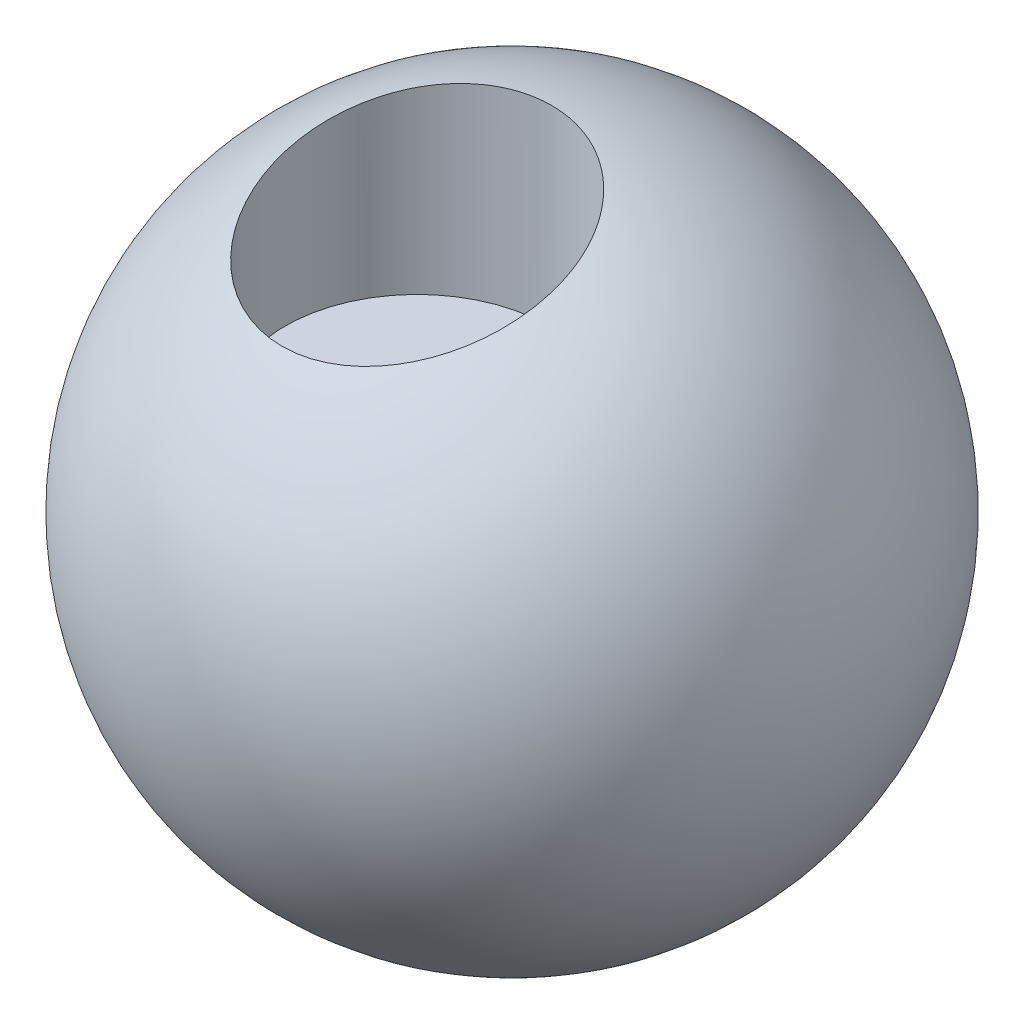
ISO-10303-21;
HEADER;
FILE_DESCRIPTION(('STEP AP214'),'2;1');
FILE_NAME('part.step','',(''),(''),'','','');
FILE_SCHEMA(('AUTOMOTIVE_DESIGN { 1 0 10303 214 1 1 1 1 }'));
ENDSEC;
DATA;
#1=APPLICATION_CONTEXT('core data for automotive mechanical design processes');
#2=APPLICATION_PROTOCOL_DEFINITION('international standard','automotive_design',2000,#1);
#3=PRODUCT_CONTEXT('',#1,'mechanical');
#4=PRODUCT('Part','Part','',(#3));
#5=PRODUCT_RELATED_PRODUCT_CATEGORY('part','',(#4));
#6=PRODUCT_DEFINITION_FORMATION('','',#4);
#7=PRODUCT_DEFINITION_CONTEXT('part definition',#1,'design');
#8=PRODUCT_DEFINITION('design','',#6,#7);
#9=PRODUCT_DEFINITION_SHAPE('','',#8);
#10=(LENGTH_UNIT() NAMED_UNIT(*) SI_UNIT(.MILLI.,.METRE.));
#11=(NAMED_UNIT(*) PLANE_ANGLE_UNIT() SI_UNIT($,.RADIAN.));
#12=(NAMED_UNIT(*) SI_UNIT($,.STERADIAN.) SOLID_ANGLE_UNIT());
#13=UNCERTAINTY_MEASURE_WITH_UNIT(LENGTH_MEASURE(1.E-05),#10,'distance_accuracy_value','');
#14=(GEOMETRIC_REPRESENTATION_CONTEXT(3) GLOBAL_UNCERTAINTY_ASSIGNED_CONTEXT((#13)) GLOBAL_UNIT_ASSIGNED_CONTEXT((#10,
#11,#12)) REPRESENTATION_CONTEXT('',''));
#15=CARTESIAN_POINT('',(0.,0.,0.));
#16=DIRECTION('',(0.,0.,1.));
#17=DIRECTION('',(1.,0.,0.));
#18=AXIS2_PLACEMENT_3D('',#15,#16,#17);
#19=CARTESIAN_POINT('',(0.,0.,0.));
#20=DIRECTION('',(0.,1.,0.));
#21=DIRECTION('',(1.,0.,0.));
#22=AXIS2_PLACEMENT_3D('',#19,#20,#21);
#23=SPHERICAL_SURFACE('',#22,100.);
#24=CARTESIAN_POINT('',(-32.3830651394079,94.6106608616789,-0.399929360318711));
#25=CARTESIAN_POINT('',(-31.6484898693131,94.8586068919636,-1.2231163236754));
#26=CARTESIAN_POINT('',(-30.8785275355345,95.0985040196887,-2.01736783511646));
#27=CARTESIAN_POINT('',(-29.2725197140086,95.5607401113787,-3.54178159135165));
#28=CARTESIAN_POINT('',(-28.4364629080942,95.7830760550382,-4.27193281409045));
#29=CARTESIAN_POINT('',(-26.702875064635,96.2089912006718,-5.6628303610567));
#30=CARTESIAN_POINT('',(-25.8052978085065,96.4125560251036,-6.32352353799325));
#31=CARTESIAN_POINT('',(-23.955119798305,96.7994701867778,-7.5694159173198));
#32=CARTESIAN_POINT('',(-23.0025215093706,96.9828204286366,-8.15461849816508));
#33=CARTESIAN_POINT('',(-21.0476916461981,97.3283375299546,-9.24516928692234));
#34=CARTESIAN_POINT('',(-20.0454113770106,97.4904830162413,-9.75043703104627));
#35=CARTESIAN_POINT('',(-17.9990659550323,97.7923336164436,-10.6759985997013));
#36=CARTESIAN_POINT('',(-16.9550001836488,97.9320383979934,-11.0962911657018));
#37=CARTESIAN_POINT('',(-14.8328242092969,98.1880598512669,-11.8480171291138));
#38=CARTESIAN_POINT('',(-13.7547216662283,98.3043817424542,-12.1794703625123));
#39=CARTESIAN_POINT('',(-11.5721862965373,98.512898750706,-12.7505483372701));
#40=CARTESIAN_POINT('',(-10.4677540556183,98.6050944039126,-12.9901751192856));
#41=CARTESIAN_POINT('',(-8.26580742904155,98.7629476882267,-13.370975783008));
#42=CARTESIAN_POINT('',(-7.16869278514396,98.8291537960783,-13.5142358907836));
#43=CARTESIAN_POINT('',(-4.96518769533131,98.9374832488853,-13.7093975265995));
#44=CARTESIAN_POINT('',(-3.858797374327,98.9796069176196,-13.7613002829228));
#45=CARTESIAN_POINT('',(-1.64494365989079,99.0394921856506,-13.7731367906991));
#46=CARTESIAN_POINT('',(-0.537480348322362,99.0572555163821,-13.7330770790162));
#47=CARTESIAN_POINT('',(1.67042289962503,99.0683079636529,-13.5611995544122));
#48=CARTESIAN_POINT('',(2.77086289530533,99.0615972871127,-13.4293825172806));
#49=CARTESIAN_POINT('',(4.93828085232615,99.0240645861383,-13.0779750524453));
#50=CARTESIAN_POINT('',(6.00551056467394,98.9936482800077,-12.8598917000578));
#51=CARTESIAN_POINT('',(8.1177556072271,98.9093939375682,-12.337712029197));
#52=CARTESIAN_POINT('',(9.16277124532439,98.8555562261073,-12.0336169037025));
#53=CARTESIAN_POINT('',(11.2232378034236,98.7248026268273,-11.3418495218075));
#54=CARTESIAN_POINT('',(12.2386894933176,98.6478873405755,-10.954179444045));
#55=CARTESIAN_POINT('',(14.2330520337276,98.4714613699761,-10.0983563767361));
#56=CARTESIAN_POINT('',(15.2119626294094,98.3719505280834,-9.63020282603316));
#57=CARTESIAN_POINT('',(17.1295605591064,98.1506116266202,-8.61557622541087));
#58=CARTESIAN_POINT('',(18.0681150323122,98.0287159210003,-8.0688669033833));
#59=CARTESIAN_POINT('',(19.8955642108477,97.7635624080653,-6.9025326659921));
#60=CARTESIAN_POINT('',(20.7844589916452,97.6203046332153,-6.28290786144236));
#61=CARTESIAN_POINT('',(22.5069194697475,97.3132851645895,-4.97551651572422));
#62=CARTESIAN_POINT('',(23.3404824586527,97.1495224682626,-4.28774664306902));
#63=CARTESIAN_POINT('',(24.947066707269,96.8024689949829,-2.84931178528893));
#64=CARTESIAN_POINT('',(25.7200870047466,96.6191779077655,-2.09864580091896));
#65=CARTESIAN_POINT('',(27.2169002997578,96.2299904775005,-0.52321954412828));
#66=CARTESIAN_POINT('',(27.9392774884156,96.0236928311013,0.302786807438496));
#67=CARTESIAN_POINT('',(29.3117441413944,95.5930574301269,2.00839074924652));
#68=CARTESIAN_POINT('',(29.9618328112277,95.3687194773262,2.8879889283248));
#69=CARTESIAN_POINT('',(31.1861152214535,94.903284336931,4.69442598454119));
#70=CARTESIAN_POINT('',(31.7603009801161,94.6621853908604,5.62126981571781));
#71=CARTESIAN_POINT('',(32.8296433015031,94.1646234574064,7.51552423346298));
#72=CARTESIAN_POINT('',(33.3247983113478,93.9081601682643,8.48293561667412));
#73=CARTESIAN_POINT('',(34.2488065738092,93.3724916814081,10.4845827478801));
#74=CARTESIAN_POINT('',(34.6748890183794,93.0928127813576,11.5199713102564));
#75=CARTESIAN_POINT('',(35.4379074588145,92.5202291670221,13.6195280651164));
#76=CARTESIAN_POINT('',(35.7748416869586,92.2273241906119,14.6836968278221));
#77=CARTESIAN_POINT('',(36.3581126459558,91.6299570254163,16.8335531009702));
#78=CARTESIAN_POINT('',(36.6044372095379,91.3254932905459,17.9192434807702));
#79=CARTESIAN_POINT('',(37.005509299737,90.7068073910667,20.1046606253297));
#80=CARTESIAN_POINT('',(37.160255148842,90.3925850478137,21.2043876468313));
#81=CARTESIAN_POINT('',(37.3815936119765,89.7450183617277,23.4493720475143));
#82=CARTESIAN_POINT('',(37.4449003053837,89.411389994249,24.5948723176336));
#83=CARTESIAN_POINT('',(37.4730858131538,88.7376993930454,26.8851947612217));
#84=CARTESIAN_POINT('',(37.4379623586843,88.3976370111948,28.0300169184516));
#85=CARTESIAN_POINT('',(37.2699243941424,87.7131805847972,30.3113199073015));
#86=CARTESIAN_POINT('',(37.1369969255852,87.3687859721976,31.447799613439));
#87=CARTESIAN_POINT('',(36.7744822391675,86.6779268470211,33.7045986886156));
#88=CARTESIAN_POINT('',(36.5448940069197,86.3314623127595,34.8249178879338));
#89=CARTESIAN_POINT('',(35.9840357018398,85.6304686232415,37.0684022191492));
#90=CARTESIAN_POINT('',(35.6504651704888,85.2759447593002,38.1909946452647));
#91=CARTESIAN_POINT('',(34.8858975886999,84.5696867042178,40.4034262857302));
#92=CARTESIAN_POINT('',(34.4548986393321,84.2179525675882,41.4932648612216));
#93=CARTESIAN_POINT('',(33.4981681640389,83.5199080527811,43.6324705336872));
#94=CARTESIAN_POINT('',(32.972429187979,83.1735981034785,44.6818344399436));
#95=CARTESIAN_POINT('',(31.8294851975645,82.4891968992823,46.7323342859823));
#96=CARTESIAN_POINT('',(31.2122808140954,82.1511055877191,47.7334705583532));
#97=CARTESIAN_POINT('',(29.8903800808977,81.4861109219506,49.6797020861451));
#98=CARTESIAN_POINT('',(29.1857105245716,81.1592041805033,50.6248143730781));
#99=CARTESIAN_POINT('',(27.6930686865017,80.5194366819795,52.4519607235882));
#100=CARTESIAN_POINT('',(26.9050957791771,80.2065760304096,53.3339943133815));
#101=CARTESIAN_POINT('',(25.2508887799305,79.5979846485927,55.0276947693849));
#102=CARTESIAN_POINT('',(24.3846606862267,79.3022526082936,55.8393670194246));
#103=CARTESIAN_POINT('',(22.5795636247118,78.7310177593839,57.3853965785069));
#104=CARTESIAN_POINT('',(21.6406970462414,78.4555142859636,58.1197564287579));
#105=CARTESIAN_POINT('',(19.7272721517931,77.9361618256534,59.4826935235949));
#106=CARTESIAN_POINT('',(18.754760071041,77.6915905491046,60.1138681852551));
#107=CARTESIAN_POINT('',(16.7541381069371,77.2271890516072,61.2916089450276));
#108=CARTESIAN_POINT('',(15.7260290161743,77.0073584780936,61.8381762488706));
#109=CARTESIAN_POINT('',(13.6217977599008,76.595222749759,62.8412210216948));
#110=CARTESIAN_POINT('',(12.5456887545313,76.4029101104527,63.2977230000043));
#111=CARTESIAN_POINT('',(10.3532658812906,76.0482972912447,64.1160409286064));
#112=CARTESIAN_POINT('',(9.23695392513713,75.8859956865134,64.4778613744196));
#113=CARTESIAN_POINT('',(7.03236919306154,75.6013635494499,65.0863812210392));
#114=CARTESIAN_POINT('',(5.94570028329138,75.4773821140932,65.3381264203861));
#115=CARTESIAN_POINT('',(3.75216192840117,75.2600597441116,65.7502982806838));
#116=CARTESIAN_POINT('',(2.64529319912119,75.1667177259059,65.9107281712008));
#117=CARTESIAN_POINT('',(0.420072382413043,75.0119857638283,66.1383557031434));
#118=CARTESIAN_POINT('',(-0.698276714917062,74.9505877050811,66.2055770300137));
#119=CARTESIAN_POINT('',(-2.93798519055444,74.8605847384477,66.2458865729349));
#120=CARTESIAN_POINT('',(-4.05934448733567,74.8319789512443,66.2189773131544));
#121=CARTESIAN_POINT('',(-6.24725358134968,74.808495198985,66.0742761897407));
#122=CARTESIAN_POINT('',(-7.31405656548194,74.8121975663401,65.9605084484974));
#123=CARTESIAN_POINT('',(-9.43452838193089,74.8499121611239,65.6477656615506));
#124=CARTESIAN_POINT('',(-10.4881976654841,74.8839233443016,65.4487935515763));
#125=CARTESIAN_POINT('',(-12.5747686333457,74.9818014288848,64.9673255584018));
#126=CARTESIAN_POINT('',(-13.6076717879556,75.0456662087504,64.6848356109044));
#127=CARTESIAN_POINT('',(-15.6455255759747,75.2024216600303,64.038754052431));
#128=CARTESIAN_POINT('',(-16.650475996029,75.2953125529259,63.6751618226168));
#129=CARTESIAN_POINT('',(-18.6193961855475,75.508282222003,62.8725049413936));
#130=CARTESIAN_POINT('',(-19.5835821027445,75.6281881683281,62.4339241548833));
#131=CARTESIAN_POINT('',(-21.4712995438345,75.8940692791849,61.4833958251114));
#132=CARTESIAN_POINT('',(-22.3948314757912,76.0400441819755,60.9714490184796));
#133=CARTESIAN_POINT('',(-24.195613844679,76.3564098523798,59.8782559981406));
#134=CARTESIAN_POINT('',(-25.0728602868038,76.5268027227576,59.2970038168952));
#135=CARTESIAN_POINT('',(-26.7758467600297,76.890153055725,58.069725954588));
#136=CARTESIAN_POINT('',(-27.6015854420612,77.0831111089522,57.423698578116));
#137=CARTESIAN_POINT('',(-29.2237427746097,77.4964531678551,56.0489485918868));
#138=CARTESIAN_POINT('',(-30.0182467415383,77.7175403837319,55.3181780108606));
#139=CARTESIAN_POINT('',(-31.5428433728273,78.1794653458408,53.7980709555908));
#140=CARTESIAN_POINT('',(-32.2729349287397,78.4203034318202,53.0087334739226));
#141=CARTESIAN_POINT('',(-33.664948120779,78.9194812984312,51.3770304980649));
#142=CARTESIAN_POINT('',(-34.3268579057335,79.1778241087934,50.5346558259548));
#143=CARTESIAN_POINT('',(-35.5790340108096,79.7096840249019,48.8027793856811));
#144=CARTESIAN_POINT('',(-36.1692983328358,79.9832015535409,47.9132763041631));
#145=CARTESIAN_POINT('',(-37.3038430152865,80.557583111855,46.0460615392709));
#146=CARTESIAN_POINT('',(-37.8441868818965,80.859130027698,45.0661663871864));
#147=CARTESIAN_POINT('',(-38.839730849442,81.4739275603969,43.0675682182245));
#148=CARTESIAN_POINT('',(-39.2949282758623,81.7871785445161,42.0488639835333));
#149=CARTESIAN_POINT('',(-40.1179659075519,82.4229278359544,39.9793823706684));
#150=CARTESIAN_POINT('',(-40.4857936583992,82.7454274543186,38.9286004439295));
#151=CARTESIAN_POINT('',(-41.1322106271549,83.3972154861826,36.8019982146963));
#152=CARTESIAN_POINT('',(-41.4107982301552,83.7265040224214,35.726177459472));
#153=CARTESIAN_POINT('',(-41.8872458640561,84.4035821627857,33.5104628635538));
#154=CARTESIAN_POINT('',(-42.0811900503694,84.7515649364687,32.3697843574274));
#155=CARTESIAN_POINT('',(-42.3695777348119,85.4498379278945,30.0765949092356));
#156=CARTESIAN_POINT('',(-42.4640179665654,85.8001282210055,28.9240835799927));
#157=CARTESIAN_POINT('',(-42.5528424974266,86.5006860312044,26.6147572889538));
#158=CARTESIAN_POINT('',(-42.5471917154629,86.8509534972764,25.4579409603257));
#159=CARTESIAN_POINT('',(-42.4356821444567,87.5489736454504,23.1484018678783));
#160=CARTESIAN_POINT('',(-42.329824540493,87.8967263572437,21.9956790558098));
#161=CARTESIAN_POINT('',(-42.0157838025196,88.5931327695206,19.6834328925866));
#162=CARTESIAN_POINT('',(-41.8059446938436,88.941707042887,18.5241100322913));
#163=CARTESIAN_POINT('',(-41.2842129986217,89.6316160510511,16.2263428256671));
#164=CARTESIAN_POINT('',(-40.9723126228001,89.9729502311699,15.0879000799059));
#165=CARTESIAN_POINT('',(-40.2485284637727,90.6457412708205,12.8417124245608));
#166=CARTESIAN_POINT('',(-39.836751382893,90.9772082503871,11.7339361506105));
#167=CARTESIAN_POINT('',(-38.9153925456839,91.6284290479412,9.55646201273438));
#168=CARTESIAN_POINT('',(-38.4058360406209,91.9481858647127,8.48675440204747));
#169=CARTESIAN_POINT('',(-37.4755640514096,92.4707980113476,6.73868825524509));
#170=CARTESIAN_POINT('',(-37.0808724674585,92.6774660506307,6.04748604229942));
#171=CARTESIAN_POINT('',(-36.2499095998401,93.0840459288023,4.68829844144188));
#172=CARTESIAN_POINT('',(-35.8136334317953,93.2839569702932,4.02031579342344));
#173=CARTESIAN_POINT('',(-34.9008075542748,93.6763808923449,2.71020441794283));
#174=CARTESIAN_POINT('',(-34.4242583902368,93.86889387305,2.06807534050655));
#175=CARTESIAN_POINT('',(-33.4323914030738,94.2459086831115,0.812226391106925));
#176=CARTESIAN_POINT('',(-32.9170790340176,94.4304116337567,0.198502542020361));
#177=CARTESIAN_POINT('',(-32.3830651394079,94.6106608616789,-0.399929360318711));
#178=B_SPLINE_CURVE_WITH_KNOTS('',3,(#24,#25,#26,#27,#28,#29,#30,#31,#32,#33,#34,#35,#36,#37,
#38,#39,#40,#41,#42,#43,#44,#45,#46,#47,#48,#49,#50,#51,#52,#53,#54,#55,#56,#57,#58,#59,#60,#61,
#62,#63,#64,#65,#66,#67,#68,#69,#70,#71,#72,#73,#74,#75,#76,#77,#78,#79,#80,#81,#82,#83,#84,#85,
#86,#87,#88,#89,#90,#91,#92,#93,#94,#95,#96,#97,#98,#99,#100,#101,#102,#103,#104,#105,#106,#107,
#108,#109,#110,#111,#112,#113,#114,#115,#116,#117,#118,#119,#120,#121,#122,#123,#124,#125,#126,
#127,#128,#129,#130,#131,#132,#133,#134,#135,#136,#137,#138,#139,#140,#141,#142,#143,#144,#145,
#146,#147,#148,#149,#150,#151,#152,#153,#154,#155,#156,#157,#158,#159,#160,#161,#162,#163,#164,
#165,#166,#167,#168,#169,#170,#171,#172,#173,#174,#175,#176,#177),.UNSPECIFIED.,.T.,.F.,(4,2,2,
2,2,2,2,2,2,2,2,2,2,2,2,2,2,2,2,2,2,2,2,2,2,2,2,2,2,2,2,2,2,2,2,2,2,2,2,2,2,2,2,2,2,2,2,2,2,2,2,
2,2,2,2,2,2,2,2,2,2,2,2,2,2,2,2,2,2,2,2,2,2,2,2,2,4),(0.,3.39171156523199,6.78400519818923,
10.1788759078884,13.5735946330829,16.9717090914403,20.369873874112,23.7672792835596,
27.1646091882037,30.4857956693244,33.8069374973586,37.127843259738,40.4487209448762,
43.7139779594603,46.9791896873191,50.2443163076923,53.5094656945032,56.7846496304541,
60.0598285889817,63.335167744052,66.6105589450639,69.9563747622826,73.3022273480868,
76.6484314946295,79.9947013828311,83.4528698062202,86.9111067965297,90.3698079973644,
93.8285725517126,97.4087779433645,100.989065860064,104.569828230327,108.15062817913,
111.817064737723,115.483572763205,119.150369240238,122.817140426609,126.482791122147,
130.148469347469,133.813866838521,137.479143812701,141.029337681659,144.579480952512,
148.12865679215,151.677664084775,155.040384784409,158.402986546658,161.764733673671,
165.126390654092,168.341101246233,171.555701083957,174.770072511505,177.984468466654,
181.178856428339,184.373212319092,187.567843458708,190.76255823566,194.064513863559,
197.36652630244,200.669111723183,203.971789227429,207.444640942161,210.917601723526,
214.391057273765,217.864575676821,221.485110303366,225.105763776026,228.727686282843,
232.34956595615,236.031075569353,239.712866219478,243.390740655938,247.067666566614,
249.533427530364,251.999478471361,254.465496018736,256.931167238663),.UNSPECIFIED.);
#179=CARTESIAN_POINT('',(-32.3830651394079,94.6106608616789,-0.399929360318711));
#180=VERTEX_POINT('',#179);
#181=EDGE_CURVE('E10',#180,#180,#178,.T.);
#182=ORIENTED_EDGE('',*,*,#181,.T.);
#183=EDGE_LOOP('',(#182));
#184=FACE_BOUND('',#183,.T.);
#185=ADVANCED_FACE('F37',(#184),#23,.T.);
#186=CARTESIAN_POINT('',(-2.53797886033453,40.7052114751395,26.2322095886029));
#187=DIRECTION('',(0.,1.,0.));
#188=DIRECTION('',(0.,0.,1.));
#189=AXIS2_PLACEMENT_3D('',#186,#187,#188);
#190=CYLINDRICAL_SURFACE('',#189,40.);
#191=ORIENTED_EDGE('',*,*,#181,.F.);
#192=EDGE_LOOP('',(#191));
#193=FACE_BOUND('',#192,.T.);
#194=CARTESIAN_POINT('',(-2.53797886033453,40.7052114751395,26.2322095886029));
#195=DIRECTION('',(0.,-1.,0.));
#196=DIRECTION('',(0.,0.,-1.));
#197=AXIS2_PLACEMENT_3D('',#194,#195,#196);
#198=CIRCLE('',#197,40.);
#199=CARTESIAN_POINT('',(-2.53797886033453,40.7052114751395,-13.7677904113971));
#200=VERTEX_POINT('',#199);
#201=EDGE_CURVE('E47',#200,#200,#198,.T.);
#202=ORIENTED_EDGE('',*,*,#201,.T.);
#203=EDGE_LOOP('',(#202));
#204=FACE_BOUND('',#203,.T.);
#205=ADVANCED_FACE('F83',(#193,#204),#190,.F.);
#206=CARTESIAN_POINT('',(-2.53797886033453,40.7052114751395,26.2322095886029));
#207=DIRECTION('',(0.,-1.,0.));
#208=DIRECTION('',(0.,0.,-1.));
#209=AXIS2_PLACEMENT_3D('',#206,#207,#208);
#210=PLANE('',#209);
#211=ORIENTED_EDGE('',*,*,#201,.F.);
#212=EDGE_LOOP('',(#211));
#213=FACE_BOUND('',#212,.T.);
#214=ADVANCED_FACE('F82',(#213),#210,.F.);
#215=CLOSED_SHELL('',(#185,#205,#214));
#216=CARTESIAN_POINT('',(-65.,0.,-60.));
#217=DIRECTION('',(1.,0.,0.));
#218=DIRECTION('',(0.,0.,-1.));
#219=AXIS2_PLACEMENT_3D('',#216,#217,#218);
#220=CYLINDRICAL_SURFACE('',#219,12.);
#221=CARTESIAN_POINT('',(-65.,0.,-60.));
#222=DIRECTION('',(1.,0.,0.));
#223=DIRECTION('',(0.,0.,-1.));
#224=AXIS2_PLACEMENT_3D('',#221,#222,#223);
#225=CIRCLE('',#224,12.);
#226=CARTESIAN_POINT('',(-65.,0.,-72.));
#227=VERTEX_POINT('',#226);
#228=EDGE_CURVE('E51',#227,#227,#225,.T.);
#229=ORIENTED_EDGE('',*,*,#228,.F.);
#230=EDGE_LOOP('',(#229));
#231=FACE_BOUND('',#230,.T.);
#232=CARTESIAN_POINT('',(65.,0.,-60.));
#233=DIRECTION('',(1.,0.,0.));
#234=DIRECTION('',(0.,0.,-1.));
#235=AXIS2_PLACEMENT_3D('',#232,#233,#234);
#236=CIRCLE('',#235,12.);
#237=CARTESIAN_POINT('',(65.,0.,-72.));
#238=VERTEX_POINT('',#237);
#239=EDGE_CURVE('E55',#238,#238,#236,.T.);
#240=ORIENTED_EDGE('',*,*,#239,.T.);
#241=EDGE_LOOP('',(#240));
#242=FACE_BOUND('',#241,.T.);
#243=ADVANCED_FACE('F61',(#231,#242),#220,.F.);
#244=CARTESIAN_POINT('',(-65.,0.,-60.));
#245=DIRECTION('',(1.,0.,0.));
#246=DIRECTION('',(0.,0.,-1.));
#247=AXIS2_PLACEMENT_3D('',#244,#245,#246);
#248=PLANE('',#247);
#249=ORIENTED_EDGE('',*,*,#228,.T.);
#250=EDGE_LOOP('',(#249));
#251=FACE_BOUND('',#250,.T.);
#252=ADVANCED_FACE('F65',(#251),#248,.T.);
#253=CARTESIAN_POINT('',(65.,0.,-60.));
#254=DIRECTION('',(1.,0.,0.));
#255=DIRECTION('',(0.,0.,-1.));
#256=AXIS2_PLACEMENT_3D('',#253,#254,#255);
#257=PLANE('',#256);
#258=ORIENTED_EDGE('',*,*,#239,.F.);
#259=EDGE_LOOP('',(#258));
#260=FACE_BOUND('',#259,.T.);
#261=ADVANCED_FACE('F63',(#260),#257,.F.);
#262=CLOSED_SHELL('',(#243,#252,#261));
#263=ORIENTED_CLOSED_SHELL('',*,#262,.T.);
#264=BREP_WITH_VOIDS('B2',#215,(#263));
#265=ADVANCED_BREP_SHAPE_REPRESENTATION('',(#18,#264),#14);
#266=SHAPE_DEFINITION_REPRESENTATION(#9,#265);
ENDSEC;
END-ISO-10303-21;
